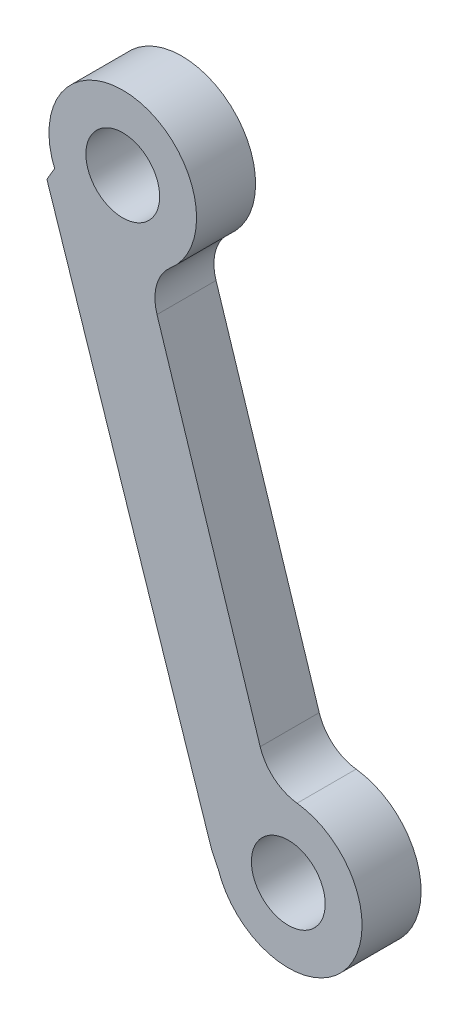
ISO-10303-21;
HEADER;
FILE_DESCRIPTION(('STEP AP214'),'2;1');
FILE_NAME('part.step','',(''),(''),'','','');
FILE_SCHEMA(('AUTOMOTIVE_DESIGN { 1 0 10303 214 1 1 1 1 }'));
ENDSEC;
DATA;
#1=APPLICATION_CONTEXT('core data for automotive mechanical design processes');
#2=APPLICATION_PROTOCOL_DEFINITION('international standard','automotive_design',2000,#1);
#3=PRODUCT_CONTEXT('',#1,'mechanical');
#4=PRODUCT('Part','Part','',(#3));
#5=PRODUCT_RELATED_PRODUCT_CATEGORY('part','',(#4));
#6=PRODUCT_DEFINITION_FORMATION('','',#4);
#7=PRODUCT_DEFINITION_CONTEXT('part definition',#1,'design');
#8=PRODUCT_DEFINITION('design','',#6,#7);
#9=PRODUCT_DEFINITION_SHAPE('','',#8);
#10=(LENGTH_UNIT() NAMED_UNIT(*) SI_UNIT(.MILLI.,.METRE.));
#11=(NAMED_UNIT(*) PLANE_ANGLE_UNIT() SI_UNIT($,.RADIAN.));
#12=(NAMED_UNIT(*) SI_UNIT($,.STERADIAN.) SOLID_ANGLE_UNIT());
#13=UNCERTAINTY_MEASURE_WITH_UNIT(LENGTH_MEASURE(1.E-05),#10,'distance_accuracy_value','');
#14=(GEOMETRIC_REPRESENTATION_CONTEXT(3) GLOBAL_UNCERTAINTY_ASSIGNED_CONTEXT((#13)) GLOBAL_UNIT_ASSIGNED_CONTEXT((#10,
#11,#12)) REPRESENTATION_CONTEXT('',''));
#15=CARTESIAN_POINT('',(0.,0.,0.));
#16=DIRECTION('',(0.,0.,1.));
#17=DIRECTION('',(1.,0.,0.));
#18=AXIS2_PLACEMENT_3D('',#15,#16,#17);
#19=CARTESIAN_POINT('',(8.9793514386525,86.4261615354982,4.));
#20=DIRECTION('',(0.,0.,1.));
#21=DIRECTION('',(1.,0.,0.));
#22=AXIS2_PLACEMENT_3D('',#19,#20,#21);
#23=PLANE('',#22);
#24=CARTESIAN_POINT('',(8.9793514386525,86.4261615354982,4.));
#25=DIRECTION('',(0.,0.,1.));
#26=DIRECTION('',(1.,0.,0.));
#27=AXIS2_PLACEMENT_3D('',#24,#25,#26);
#28=CIRCLE('',#27,2.5);
#29=CARTESIAN_POINT('',(11.4793514386525,86.4261615354982,4.));
#30=VERTEX_POINT('',#29);
#31=EDGE_CURVE('E263',#30,#30,#28,.T.);
#32=ORIENTED_EDGE('',*,*,#31,.F.);
#33=EDGE_LOOP('',(#32));
#34=FACE_BOUND('',#33,.T.);
#35=DIRECTION('',(-0.304553215522507,0.952495322253554,0.));
#36=VECTOR('',#35,1.);
#37=CARTESIAN_POINT('',(10.573135960312,81.6869790217604,4.));
#38=LINE('',#37,#36);
#39=CARTESIAN_POINT('',(18.2905128783695,57.550752445049,4.));
#40=VERTEX_POINT('',#39);
#41=CARTESIAN_POINT('',(11.2998254082475,79.4142455071855,4.));
#42=VERTEX_POINT('',#41);
#43=EDGE_CURVE('E274',#40,#42,#38,.T.);
#44=ORIENTED_EDGE('',*,*,#43,.T.);
#45=CARTESIAN_POINT('',(14.1573113750082,80.3279051537531,4.));
#46=DIRECTION('',(0.,0.,1.));
#47=DIRECTION('',(1.,0.,0.));
#48=AXIS2_PLACEMENT_3D('',#45,#46,#47);
#49=CIRCLE('',#48,3.);
#50=CARTESIAN_POINT('',(12.2155763988748,82.6147512969075,4.));
#51=VERTEX_POINT('',#50);
#52=EDGE_CURVE('E11',#42,#51,#49,.F.);
#53=ORIENTED_EDGE('',*,*,#52,.T.);
#54=CARTESIAN_POINT('',(8.9793514386525,86.4261615354982,4.));
#55=DIRECTION('',(0.,0.,1.));
#56=DIRECTION('',(1.,0.,0.));
#57=AXIS2_PLACEMENT_3D('',#54,#55,#56);
#58=CIRCLE('',#57,5.);
#59=CARTESIAN_POINT('',(4.36118664892974,84.5097706633208,4.));
#60=VERTEX_POINT('',#59);
#61=EDGE_CURVE('E93',#51,#60,#58,.T.);
#62=ORIENTED_EDGE('',*,*,#61,.T.);
#63=DIRECTION('',(-0.507602263513174,-0.861591516947737,0.));
#64=VECTOR('',#63,1.);
#65=CARTESIAN_POINT('',(3.83869237847881,83.6229018224323,4.));
#66=LINE('',#65,#64);
#67=CARTESIAN_POINT('',(3.83869237847881,83.6229018224323,4.));
#68=VERTEX_POINT('',#67);
#69=EDGE_CURVE('E96',#60,#68,#66,.T.);
#70=ORIENTED_EDGE('',*,*,#69,.T.);
#71=DIRECTION('',(0.313907516438917,-0.949453564490203,0.));
#72=VECTOR('',#71,1.);
#73=CARTESIAN_POINT('',(15.0110533623116,49.8306623749407,4.));
#74=LINE('',#73,#72);
#75=CARTESIAN_POINT('',(15.0110533623116,49.8306623749407,4.));
#76=VERTEX_POINT('',#75);
#77=EDGE_CURVE('E109',#68,#76,#74,.T.);
#78=ORIENTED_EDGE('',*,*,#77,.T.);
#79=DIRECTION('',(0.441640485602026,-0.897192109571415,0.));
#80=VECTOR('',#79,1.);
#81=CARTESIAN_POINT('',(15.0110533623116,49.8306623749407,4.));
#82=LINE('',#81,#80);
#83=CARTESIAN_POINT('',(15.4550916296435,48.9285991747001,4.));
#84=VERTEX_POINT('',#83);
#85=EDGE_CURVE('E269',#76,#84,#82,.T.);
#86=ORIENTED_EDGE('',*,*,#85,.T.);
#87=CARTESIAN_POINT('',(20.1945960019734,50.5214263168174,4.));
#88=DIRECTION('',(0.,0.,1.));
#89=DIRECTION('',(1.,0.,0.));
#90=AXIS2_PLACEMENT_3D('',#87,#88,#89);
#91=CIRCLE('',#90,5.);
#92=CARTESIAN_POINT('',(20.7904727789463,55.4857924260669,4.));
#93=VERTEX_POINT('',#92);
#94=EDGE_CURVE('E271',#84,#93,#91,.T.);
#95=ORIENTED_EDGE('',*,*,#94,.T.);
#96=CARTESIAN_POINT('',(21.1479988451301,58.4644120916165,4.));
#97=DIRECTION('',(0.,0.,1.));
#98=DIRECTION('',(1.,0.,0.));
#99=AXIS2_PLACEMENT_3D('',#96,#97,#98);
#100=CIRCLE('',#99,3.);
#101=EDGE_CURVE('E131',#93,#40,#100,.F.);
#102=ORIENTED_EDGE('',*,*,#101,.T.);
#103=EDGE_LOOP('',(#44,#53,#62,#70,#78,#86,#95,#102));
#104=FACE_BOUND('',#103,.T.);
#105=CARTESIAN_POINT('',(20.1945960019734,50.5214263168174,4.));
#106=DIRECTION('',(0.,0.,1.));
#107=DIRECTION('',(1.,0.,0.));
#108=AXIS2_PLACEMENT_3D('',#105,#106,#107);
#109=CIRCLE('',#108,2.5);
#110=CARTESIAN_POINT('',(22.6945960019734,50.5214263168174,4.));
#111=VERTEX_POINT('',#110);
#112=EDGE_CURVE('E254',#111,#111,#109,.T.);
#113=ORIENTED_EDGE('',*,*,#112,.F.);
#114=EDGE_LOOP('',(#113));
#115=FACE_BOUND('',#114,.T.);
#116=ADVANCED_FACE('F32',(#34,#104,#115),#23,.T.);
#117=CARTESIAN_POINT('',(8.9793514386525,86.4261615354982,0.));
#118=DIRECTION('',(0.,0.,1.));
#119=DIRECTION('',(1.,0.,0.));
#120=AXIS2_PLACEMENT_3D('',#117,#118,#119);
#121=PLANE('',#120);
#122=CARTESIAN_POINT('',(8.9793514386525,86.4261615354982,0.));
#123=DIRECTION('',(0.,0.,1.));
#124=DIRECTION('',(1.,0.,0.));
#125=AXIS2_PLACEMENT_3D('',#122,#123,#124);
#126=CIRCLE('',#125,5.);
#127=CARTESIAN_POINT('',(12.2155763988748,82.6147512969075,0.));
#128=VERTEX_POINT('',#127);
#129=CARTESIAN_POINT('',(4.36118664892974,84.5097706633208,0.));
#130=VERTEX_POINT('',#129);
#131=EDGE_CURVE('E113',#128,#130,#126,.T.);
#132=ORIENTED_EDGE('',*,*,#131,.F.);
#133=CARTESIAN_POINT('',(14.1573113750082,80.3279051537531,0.));
#134=DIRECTION('',(0.,0.,1.));
#135=DIRECTION('',(1.,0.,0.));
#136=AXIS2_PLACEMENT_3D('',#133,#134,#135);
#137=CIRCLE('',#136,3.);
#138=CARTESIAN_POINT('',(11.2998254082475,79.4142455071855,0.));
#139=VERTEX_POINT('',#138);
#140=EDGE_CURVE('E40',#128,#139,#137,.T.);
#141=ORIENTED_EDGE('',*,*,#140,.T.);
#142=DIRECTION('',(-0.304553215522507,0.952495322253554,0.));
#143=VECTOR('',#142,1.);
#144=CARTESIAN_POINT('',(10.573135960312,81.6869790217604,0.));
#145=LINE('',#144,#143);
#146=CARTESIAN_POINT('',(18.2905128783695,57.550752445049,0.));
#147=VERTEX_POINT('',#146);
#148=EDGE_CURVE('E100',#147,#139,#145,.T.);
#149=ORIENTED_EDGE('',*,*,#148,.F.);
#150=CARTESIAN_POINT('',(21.1479988451301,58.4644120916165,0.));
#151=DIRECTION('',(0.,0.,1.));
#152=DIRECTION('',(1.,0.,0.));
#153=AXIS2_PLACEMENT_3D('',#150,#151,#152);
#154=CIRCLE('',#153,3.);
#155=CARTESIAN_POINT('',(20.7904727789463,55.4857924260669,0.));
#156=VERTEX_POINT('',#155);
#157=EDGE_CURVE('E129',#147,#156,#154,.T.);
#158=ORIENTED_EDGE('',*,*,#157,.T.);
#159=CARTESIAN_POINT('',(20.1945960019734,50.5214263168174,0.));
#160=DIRECTION('',(0.,0.,1.));
#161=DIRECTION('',(1.,0.,0.));
#162=AXIS2_PLACEMENT_3D('',#159,#160,#161);
#163=CIRCLE('',#162,5.);
#164=CARTESIAN_POINT('',(15.4550916296435,48.9285991747001,0.));
#165=VERTEX_POINT('',#164);
#166=EDGE_CURVE('E141',#165,#156,#163,.T.);
#167=ORIENTED_EDGE('',*,*,#166,.F.);
#168=DIRECTION('',(0.441640485602026,-0.897192109571415,0.));
#169=VECTOR('',#168,1.);
#170=CARTESIAN_POINT('',(15.0110533623116,49.8306623749407,0.));
#171=LINE('',#170,#169);
#172=CARTESIAN_POINT('',(15.0110533623116,49.8306623749407,0.));
#173=VERTEX_POINT('',#172);
#174=EDGE_CURVE('E282',#173,#165,#171,.T.);
#175=ORIENTED_EDGE('',*,*,#174,.F.);
#176=DIRECTION('',(0.313907516438917,-0.949453564490203,0.));
#177=VECTOR('',#176,1.);
#178=CARTESIAN_POINT('',(15.0110533623116,49.8306623749407,0.));
#179=LINE('',#178,#177);
#180=CARTESIAN_POINT('',(3.83869237847881,83.6229018224323,0.));
#181=VERTEX_POINT('',#180);
#182=EDGE_CURVE('E280',#181,#173,#179,.T.);
#183=ORIENTED_EDGE('',*,*,#182,.F.);
#184=DIRECTION('',(-0.507602263513174,-0.861591516947737,0.));
#185=VECTOR('',#184,1.);
#186=CARTESIAN_POINT('',(3.83869237847881,83.6229018224323,0.));
#187=LINE('',#186,#185);
#188=EDGE_CURVE('E278',#130,#181,#187,.T.);
#189=ORIENTED_EDGE('',*,*,#188,.F.);
#190=EDGE_LOOP('',(#132,#141,#149,#158,#167,#175,#183,#189));
#191=FACE_BOUND('',#190,.T.);
#192=CARTESIAN_POINT('',(8.9793514386525,86.4261615354982,0.));
#193=DIRECTION('',(0.,0.,1.));
#194=DIRECTION('',(1.,0.,0.));
#195=AXIS2_PLACEMENT_3D('',#192,#193,#194);
#196=CIRCLE('',#195,2.5);
#197=CARTESIAN_POINT('',(11.4793514386525,86.4261615354982,0.));
#198=VERTEX_POINT('',#197);
#199=EDGE_CURVE('E260',#198,#198,#196,.T.);
#200=ORIENTED_EDGE('',*,*,#199,.T.);
#201=EDGE_LOOP('',(#200));
#202=FACE_BOUND('',#201,.T.);
#203=CARTESIAN_POINT('',(20.1945960019734,50.5214263168174,0.));
#204=DIRECTION('',(0.,0.,1.));
#205=DIRECTION('',(1.,0.,0.));
#206=AXIS2_PLACEMENT_3D('',#203,#204,#205);
#207=CIRCLE('',#206,2.5);
#208=CARTESIAN_POINT('',(22.6945960019734,50.5214263168174,0.));
#209=VERTEX_POINT('',#208);
#210=EDGE_CURVE('E257',#209,#209,#207,.T.);
#211=ORIENTED_EDGE('',*,*,#210,.T.);
#212=EDGE_LOOP('',(#211));
#213=FACE_BOUND('',#212,.T.);
#214=ADVANCED_FACE('F135',(#191,#202,#213),#121,.F.);
#215=CARTESIAN_POINT('',(8.9793514386525,86.4261615354982,4.));
#216=DIRECTION('',(0.,0.,-1.));
#217=DIRECTION('',(-1.,0.,0.));
#218=AXIS2_PLACEMENT_3D('',#215,#216,#217);
#219=CYLINDRICAL_SURFACE('',#218,5.);
#220=ORIENTED_EDGE('',*,*,#61,.F.);
#221=DIRECTION('',(0.,0.,-1.));
#222=VECTOR('',#221,1.);
#223=CARTESIAN_POINT('',(12.2155763988748,82.6147512969075,4.));
#224=LINE('',#223,#222);
#225=EDGE_CURVE('E127',#51,#128,#224,.T.);
#226=ORIENTED_EDGE('',*,*,#225,.T.);
#227=ORIENTED_EDGE('',*,*,#131,.T.);
#228=DIRECTION('',(0.,0.,-1.));
#229=VECTOR('',#228,1.);
#230=CARTESIAN_POINT('',(4.36118664892974,84.5097706633208,4.));
#231=LINE('',#230,#229);
#232=EDGE_CURVE('E105',#60,#130,#231,.T.);
#233=ORIENTED_EDGE('',*,*,#232,.F.);
#234=EDGE_LOOP('',(#220,#226,#227,#233));
#235=FACE_BOUND('',#234,.T.);
#236=ADVANCED_FACE('F111',(#235),#219,.T.);
#237=CARTESIAN_POINT('',(3.83869237847881,83.6229018224323,4.));
#238=DIRECTION('',(0.861591516947737,-0.507602263513174,0.));
#239=DIRECTION('',(0.507602263513174,0.861591516947737,0.));
#240=AXIS2_PLACEMENT_3D('',#237,#238,#239);
#241=PLANE('',#240);
#242=ORIENTED_EDGE('',*,*,#188,.T.);
#243=DIRECTION('',(0.,0.,-1.));
#244=VECTOR('',#243,1.);
#245=CARTESIAN_POINT('',(3.83869237847881,83.6229018224323,4.));
#246=LINE('',#245,#244);
#247=EDGE_CURVE('E107',#68,#181,#246,.T.);
#248=ORIENTED_EDGE('',*,*,#247,.F.);
#249=ORIENTED_EDGE('',*,*,#69,.F.);
#250=ORIENTED_EDGE('',*,*,#232,.T.);
#251=EDGE_LOOP('',(#242,#248,#249,#250));
#252=FACE_BOUND('',#251,.T.);
#253=ADVANCED_FACE('F104',(#252),#241,.F.);
#254=CARTESIAN_POINT('',(15.0110533623116,49.8306623749407,4.));
#255=DIRECTION('',(0.949453564490203,0.313907516438917,0.));
#256=DIRECTION('',(-0.313907516438917,0.949453564490203,0.));
#257=AXIS2_PLACEMENT_3D('',#254,#255,#256);
#258=PLANE('',#257);
#259=ORIENTED_EDGE('',*,*,#182,.T.);
#260=DIRECTION('',(0.,0.,-1.));
#261=VECTOR('',#260,1.);
#262=CARTESIAN_POINT('',(15.0110533623116,49.8306623749407,4.));
#263=LINE('',#262,#261);
#264=EDGE_CURVE('E119',#76,#173,#263,.T.);
#265=ORIENTED_EDGE('',*,*,#264,.F.);
#266=ORIENTED_EDGE('',*,*,#77,.F.);
#267=ORIENTED_EDGE('',*,*,#247,.T.);
#268=EDGE_LOOP('',(#259,#265,#266,#267));
#269=FACE_BOUND('',#268,.T.);
#270=ADVANCED_FACE('F171',(#269),#258,.F.);
#271=CARTESIAN_POINT('',(15.0110533623116,49.8306623749407,4.));
#272=DIRECTION('',(0.897192109571415,0.441640485602026,0.));
#273=DIRECTION('',(-0.441640485602026,0.897192109571415,0.));
#274=AXIS2_PLACEMENT_3D('',#271,#272,#273);
#275=PLANE('',#274);
#276=ORIENTED_EDGE('',*,*,#174,.T.);
#277=DIRECTION('',(0.,0.,-1.));
#278=VECTOR('',#277,1.);
#279=CARTESIAN_POINT('',(15.4550916296435,48.9285991747001,4.));
#280=LINE('',#279,#278);
#281=EDGE_CURVE('E276',#84,#165,#280,.T.);
#282=ORIENTED_EDGE('',*,*,#281,.F.);
#283=ORIENTED_EDGE('',*,*,#85,.F.);
#284=ORIENTED_EDGE('',*,*,#264,.T.);
#285=EDGE_LOOP('',(#276,#282,#283,#284));
#286=FACE_BOUND('',#285,.T.);
#287=ADVANCED_FACE('F167',(#286),#275,.F.);
#288=CARTESIAN_POINT('',(20.1945960019734,50.5214263168174,4.));
#289=DIRECTION('',(0.,0.,-1.));
#290=DIRECTION('',(-1.,0.,0.));
#291=AXIS2_PLACEMENT_3D('',#288,#289,#290);
#292=CYLINDRICAL_SURFACE('',#291,5.);
#293=ORIENTED_EDGE('',*,*,#166,.T.);
#294=DIRECTION('',(0.,0.,-1.));
#295=VECTOR('',#294,1.);
#296=CARTESIAN_POINT('',(20.7904727789463,55.4857924260669,4.));
#297=LINE('',#296,#295);
#298=EDGE_CURVE('E125',#156,#93,#297,.F.);
#299=ORIENTED_EDGE('',*,*,#298,.T.);
#300=ORIENTED_EDGE('',*,*,#94,.F.);
#301=ORIENTED_EDGE('',*,*,#281,.T.);
#302=EDGE_LOOP('',(#293,#299,#300,#301));
#303=FACE_BOUND('',#302,.T.);
#304=ADVANCED_FACE('F164',(#303),#292,.T.);
#305=CARTESIAN_POINT('',(10.573135960312,81.6869790217604,4.));
#306=DIRECTION('',(-0.952495322253554,-0.304553215522507,0.));
#307=DIRECTION('',(0.304553215522507,-0.952495322253554,0.));
#308=AXIS2_PLACEMENT_3D('',#305,#306,#307);
#309=PLANE('',#308);
#310=ORIENTED_EDGE('',*,*,#43,.F.);
#311=DIRECTION('',(0.,0.,1.));
#312=VECTOR('',#311,1.);
#313=CARTESIAN_POINT('',(18.2905128783695,57.550752445049,0.));
#314=LINE('',#313,#312);
#315=EDGE_CURVE('E117',#40,#147,#314,.F.);
#316=ORIENTED_EDGE('',*,*,#315,.T.);
#317=ORIENTED_EDGE('',*,*,#148,.T.);
#318=DIRECTION('',(0.,0.,1.));
#319=VECTOR('',#318,1.);
#320=CARTESIAN_POINT('',(11.2998254082475,79.4142455071855,4.));
#321=LINE('',#320,#319);
#322=EDGE_CURVE('E115',#139,#42,#321,.T.);
#323=ORIENTED_EDGE('',*,*,#322,.T.);
#324=EDGE_LOOP('',(#310,#316,#317,#323));
#325=FACE_BOUND('',#324,.T.);
#326=ADVANCED_FACE('F139',(#325),#309,.F.);
#327=CARTESIAN_POINT('',(8.9793514386525,86.4261615354982,4.));
#328=DIRECTION('',(0.,0.,-1.));
#329=DIRECTION('',(-1.,0.,0.));
#330=AXIS2_PLACEMENT_3D('',#327,#328,#329);
#331=CYLINDRICAL_SURFACE('',#330,2.5);
#332=ORIENTED_EDGE('',*,*,#31,.T.);
#333=EDGE_LOOP('',(#332));
#334=FACE_BOUND('',#333,.T.);
#335=ORIENTED_EDGE('',*,*,#199,.F.);
#336=EDGE_LOOP('',(#335));
#337=FACE_BOUND('',#336,.T.);
#338=ADVANCED_FACE('F159',(#334,#337),#331,.F.);
#339=CARTESIAN_POINT('',(20.1945960019734,50.5214263168174,4.));
#340=DIRECTION('',(0.,0.,-1.));
#341=DIRECTION('',(-1.,0.,0.));
#342=AXIS2_PLACEMENT_3D('',#339,#340,#341);
#343=CYLINDRICAL_SURFACE('',#342,2.5);
#344=ORIENTED_EDGE('',*,*,#112,.T.);
#345=EDGE_LOOP('',(#344));
#346=FACE_BOUND('',#345,.T.);
#347=ORIENTED_EDGE('',*,*,#210,.F.);
#348=EDGE_LOOP('',(#347));
#349=FACE_BOUND('',#348,.T.);
#350=ADVANCED_FACE('F148',(#346,#349),#343,.F.);
#351=CARTESIAN_POINT('',(21.1479988451301,58.4644120916165,4.));
#352=DIRECTION('',(0.,0.,-1.));
#353=DIRECTION('',(-1.,0.,0.));
#354=AXIS2_PLACEMENT_3D('',#351,#352,#353);
#355=CYLINDRICAL_SURFACE('',#354,3.);
#356=ORIENTED_EDGE('',*,*,#101,.F.);
#357=ORIENTED_EDGE('',*,*,#298,.F.);
#358=ORIENTED_EDGE('',*,*,#157,.F.);
#359=ORIENTED_EDGE('',*,*,#315,.F.);
#360=EDGE_LOOP('',(#356,#357,#358,#359));
#361=FACE_BOUND('',#360,.T.);
#362=ADVANCED_FACE('F144',(#361),#355,.F.);
#363=CARTESIAN_POINT('',(14.1573113750082,80.3279051537531,4.));
#364=DIRECTION('',(0.,0.,-1.));
#365=DIRECTION('',(-1.,0.,0.));
#366=AXIS2_PLACEMENT_3D('',#363,#364,#365);
#367=CYLINDRICAL_SURFACE('',#366,3.);
#368=ORIENTED_EDGE('',*,*,#52,.F.);
#369=ORIENTED_EDGE('',*,*,#322,.F.);
#370=ORIENTED_EDGE('',*,*,#140,.F.);
#371=ORIENTED_EDGE('',*,*,#225,.F.);
#372=EDGE_LOOP('',(#368,#369,#370,#371));
#373=FACE_BOUND('',#372,.T.);
#374=ADVANCED_FACE('F34',(#373),#367,.F.);
#375=CLOSED_SHELL('',(#116,#214,#236,#253,#270,#287,#304,#326,#338,#350,#362,#374));
#376=MANIFOLD_SOLID_BREP('B2',#375);
#377=ADVANCED_BREP_SHAPE_REPRESENTATION('',(#18,#376),#14);
#378=SHAPE_DEFINITION_REPRESENTATION(#9,#377);
ENDSEC;
END-ISO-10303-21;
